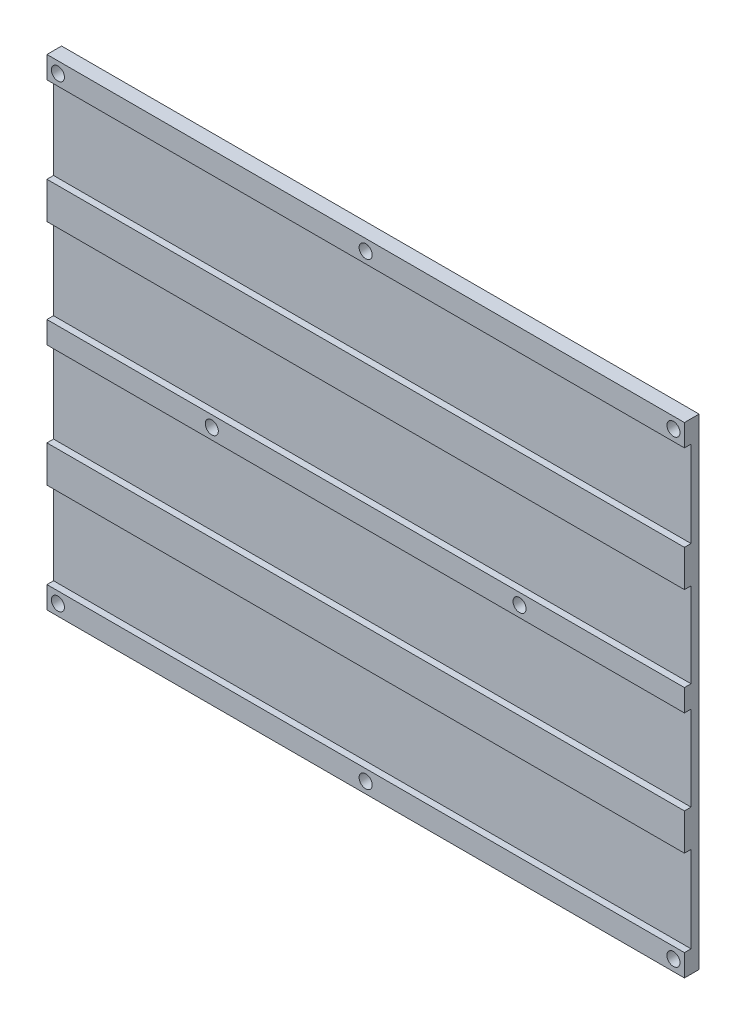
ISO-10303-21;
HEADER;
FILE_DESCRIPTION(('STEP AP214'),'2;1');
FILE_NAME('part.step','',(''),(''),'','','');
FILE_SCHEMA(('AUTOMOTIVE_DESIGN { 1 0 10303 214 1 1 1 1 }'));
ENDSEC;
DATA;
#1=APPLICATION_CONTEXT('core data for automotive mechanical design processes');
#2=APPLICATION_PROTOCOL_DEFINITION('international standard','automotive_design',2000,#1);
#3=PRODUCT_CONTEXT('',#1,'mechanical');
#4=PRODUCT('Part','Part','',(#3));
#5=PRODUCT_RELATED_PRODUCT_CATEGORY('part','',(#4));
#6=PRODUCT_DEFINITION_FORMATION('','',#4);
#7=PRODUCT_DEFINITION_CONTEXT('part definition',#1,'design');
#8=PRODUCT_DEFINITION('design','',#6,#7);
#9=PRODUCT_DEFINITION_SHAPE('','',#8);
#10=(LENGTH_UNIT() NAMED_UNIT(*) SI_UNIT(.MILLI.,.METRE.));
#11=(NAMED_UNIT(*) PLANE_ANGLE_UNIT() SI_UNIT($,.RADIAN.));
#12=(NAMED_UNIT(*) SI_UNIT($,.STERADIAN.) SOLID_ANGLE_UNIT());
#13=UNCERTAINTY_MEASURE_WITH_UNIT(LENGTH_MEASURE(1.E-05),#10,'distance_accuracy_value','');
#14=(GEOMETRIC_REPRESENTATION_CONTEXT(3) GLOBAL_UNCERTAINTY_ASSIGNED_CONTEXT((#13)) GLOBAL_UNIT_ASSIGNED_CONTEXT((#10,
#11,#12)) REPRESENTATION_CONTEXT('',''));
#15=CARTESIAN_POINT('',(0.,0.,0.));
#16=DIRECTION('',(0.,0.,1.));
#17=DIRECTION('',(1.,0.,0.));
#18=AXIS2_PLACEMENT_3D('',#15,#16,#17);
#19=CARTESIAN_POINT('',(-84.,-62.65,0.));
#20=DIRECTION('',(0.,0.,1.));
#21=DIRECTION('',(1.,0.,0.));
#22=AXIS2_PLACEMENT_3D('',#19,#20,#21);
#23=CYLINDRICAL_SURFACE('',#22,1.78435);
#24=CARTESIAN_POINT('',(-84.,-62.65,0.));
#25=DIRECTION('',(0.,0.,1.));
#26=DIRECTION('',(1.,0.,0.));
#27=AXIS2_PLACEMENT_3D('',#24,#25,#26);
#28=CIRCLE('',#27,1.78435);
#29=CARTESIAN_POINT('',(-82.21565,-62.65,0.));
#30=VERTEX_POINT('',#29);
#31=EDGE_CURVE('E285',#30,#30,#28,.F.);
#32=ORIENTED_EDGE('',*,*,#31,.F.);
#33=EDGE_LOOP('',(#32));
#34=FACE_BOUND('',#33,.T.);
#35=CARTESIAN_POINT('',(-84.,-62.65,-2.83162832727157));
#36=DIRECTION('',(0.,0.,-1.));
#37=DIRECTION('',(-1.,0.,0.));
#38=AXIS2_PLACEMENT_3D('',#35,#36,#37);
#39=CIRCLE('',#38,1.78434999998307);
#40=CARTESIAN_POINT('',(-85.7843499999831,-62.65,-2.83162832727157));
#41=VERTEX_POINT('',#40);
#42=EDGE_CURVE('E188',#41,#41,#39,.T.);
#43=ORIENTED_EDGE('',*,*,#42,.T.);
#44=EDGE_LOOP('',(#43));
#45=FACE_BOUND('',#44,.T.);
#46=ADVANCED_FACE('F16',(#34,#45),#23,.F.);
#47=CARTESIAN_POINT('',(-84.,62.65,0.));
#48=DIRECTION('',(0.,0.,1.));
#49=DIRECTION('',(1.,0.,0.));
#50=AXIS2_PLACEMENT_3D('',#47,#48,#49);
#51=CYLINDRICAL_SURFACE('',#50,1.78435);
#52=CARTESIAN_POINT('',(-84.,62.65,0.));
#53=DIRECTION('',(0.,0.,1.));
#54=DIRECTION('',(1.,0.,0.));
#55=AXIS2_PLACEMENT_3D('',#52,#53,#54);
#56=CIRCLE('',#55,1.78435);
#57=CARTESIAN_POINT('',(-82.21565,62.65,0.));
#58=VERTEX_POINT('',#57);
#59=EDGE_CURVE('E192',#58,#58,#56,.F.);
#60=ORIENTED_EDGE('',*,*,#59,.F.);
#61=EDGE_LOOP('',(#60));
#62=FACE_BOUND('',#61,.T.);
#63=CARTESIAN_POINT('',(-84.,62.65,-2.83162832727157));
#64=DIRECTION('',(0.,0.,-1.));
#65=DIRECTION('',(-1.,0.,0.));
#66=AXIS2_PLACEMENT_3D('',#63,#64,#65);
#67=CIRCLE('',#66,1.78434999998305);
#68=CARTESIAN_POINT('',(-85.7843499999831,62.65,-2.83162832727157));
#69=VERTEX_POINT('',#68);
#70=EDGE_CURVE('E246',#69,#69,#67,.T.);
#71=ORIENTED_EDGE('',*,*,#70,.T.);
#72=EDGE_LOOP('',(#71));
#73=FACE_BOUND('',#72,.T.);
#74=ADVANCED_FACE('F305',(#62,#73),#51,.F.);
#75=CARTESIAN_POINT('',(-42.,0.,0.));
#76=DIRECTION('',(0.,0.,1.));
#77=DIRECTION('',(1.,0.,0.));
#78=AXIS2_PLACEMENT_3D('',#75,#76,#77);
#79=CYLINDRICAL_SURFACE('',#78,1.78435);
#80=CARTESIAN_POINT('',(-42.,0.,0.));
#81=DIRECTION('',(0.,0.,1.));
#82=DIRECTION('',(1.,0.,0.));
#83=AXIS2_PLACEMENT_3D('',#80,#81,#82);
#84=CIRCLE('',#83,1.78435);
#85=CARTESIAN_POINT('',(-40.21565,0.,0.));
#86=VERTEX_POINT('',#85);
#87=EDGE_CURVE('E19',#86,#86,#84,.F.);
#88=ORIENTED_EDGE('',*,*,#87,.F.);
#89=EDGE_LOOP('',(#88));
#90=FACE_BOUND('',#89,.T.);
#91=CARTESIAN_POINT('',(-42.,0.,-2.83162832721473));
#92=DIRECTION('',(0.,0.,-1.));
#93=DIRECTION('',(-1.,0.,0.));
#94=AXIS2_PLACEMENT_3D('',#91,#92,#93);
#95=CIRCLE('',#94,1.78435000000991);
#96=CARTESIAN_POINT('',(-43.7843500000099,0.,-2.83162832721473));
#97=VERTEX_POINT('',#96);
#98=EDGE_CURVE('E243',#97,#97,#95,.T.);
#99=ORIENTED_EDGE('',*,*,#98,.T.);
#100=EDGE_LOOP('',(#99));
#101=FACE_BOUND('',#100,.T.);
#102=ADVANCED_FACE('F301',(#90,#101),#79,.F.);
#103=CARTESIAN_POINT('',(0.,62.65,0.));
#104=DIRECTION('',(0.,0.,1.));
#105=DIRECTION('',(1.,0.,0.));
#106=AXIS2_PLACEMENT_3D('',#103,#104,#105);
#107=CYLINDRICAL_SURFACE('',#106,1.78435);
#108=CARTESIAN_POINT('',(0.,62.65,0.));
#109=DIRECTION('',(0.,0.,1.));
#110=DIRECTION('',(1.,0.,0.));
#111=AXIS2_PLACEMENT_3D('',#108,#109,#110);
#112=CIRCLE('',#111,1.78435);
#113=CARTESIAN_POINT('',(1.78435,62.65,0.));
#114=VERTEX_POINT('',#113);
#115=EDGE_CURVE('E279',#114,#114,#112,.F.);
#116=ORIENTED_EDGE('',*,*,#115,.F.);
#117=EDGE_LOOP('',(#116));
#118=FACE_BOUND('',#117,.T.);
#119=CARTESIAN_POINT('',(0.,62.65,-2.83162832715789));
#120=DIRECTION('',(0.,0.,-1.));
#121=DIRECTION('',(-1.,0.,0.));
#122=AXIS2_PLACEMENT_3D('',#119,#120,#121);
#123=CIRCLE('',#122,1.78434999992305);
#124=CARTESIAN_POINT('',(-1.78434999992305,62.65,-2.83162832715789));
#125=VERTEX_POINT('',#124);
#126=EDGE_CURVE('E240',#125,#125,#123,.T.);
#127=ORIENTED_EDGE('',*,*,#126,.T.);
#128=EDGE_LOOP('',(#127));
#129=FACE_BOUND('',#128,.T.);
#130=ADVANCED_FACE('F304',(#118,#129),#107,.F.);
#131=CARTESIAN_POINT('',(0.,-62.65,0.));
#132=DIRECTION('',(0.,0.,1.));
#133=DIRECTION('',(1.,0.,0.));
#134=AXIS2_PLACEMENT_3D('',#131,#132,#133);
#135=CYLINDRICAL_SURFACE('',#134,1.78435);
#136=CARTESIAN_POINT('',(0.,-62.65,0.));
#137=DIRECTION('',(0.,0.,1.));
#138=DIRECTION('',(1.,0.,0.));
#139=AXIS2_PLACEMENT_3D('',#136,#137,#138);
#140=CIRCLE('',#139,1.78435);
#141=CARTESIAN_POINT('',(1.78435000000001,-62.65,0.));
#142=VERTEX_POINT('',#141);
#143=EDGE_CURVE('E288',#142,#142,#140,.F.);
#144=ORIENTED_EDGE('',*,*,#143,.F.);
#145=EDGE_LOOP('',(#144));
#146=FACE_BOUND('',#145,.T.);
#147=CARTESIAN_POINT('',(0.,-62.65,-2.83162832715789));
#148=DIRECTION('',(0.,0.,-1.));
#149=DIRECTION('',(-1.,0.,0.));
#150=AXIS2_PLACEMENT_3D('',#147,#148,#149);
#151=CIRCLE('',#150,1.78434999992307);
#152=CARTESIAN_POINT('',(-1.78434999992305,-62.65,-2.83162832715789));
#153=VERTEX_POINT('',#152);
#154=EDGE_CURVE('E237',#153,#153,#151,.T.);
#155=ORIENTED_EDGE('',*,*,#154,.T.);
#156=EDGE_LOOP('',(#155));
#157=FACE_BOUND('',#156,.T.);
#158=ADVANCED_FACE('F368',(#146,#157),#135,.F.);
#159=CARTESIAN_POINT('',(84.,-62.65,0.));
#160=DIRECTION('',(0.,0.,1.));
#161=DIRECTION('',(1.,0.,0.));
#162=AXIS2_PLACEMENT_3D('',#159,#160,#161);
#163=CYLINDRICAL_SURFACE('',#162,1.78435);
#164=CARTESIAN_POINT('',(84.,-62.65,0.));
#165=DIRECTION('',(0.,0.,1.));
#166=DIRECTION('',(1.,0.,0.));
#167=AXIS2_PLACEMENT_3D('',#164,#165,#166);
#168=CIRCLE('',#167,1.78435);
#169=CARTESIAN_POINT('',(85.78435,-62.65,0.));
#170=VERTEX_POINT('',#169);
#171=EDGE_CURVE('E195',#170,#170,#168,.F.);
#172=ORIENTED_EDGE('',*,*,#171,.F.);
#173=EDGE_LOOP('',(#172));
#174=FACE_BOUND('',#173,.T.);
#175=CARTESIAN_POINT('',(84.,-62.65,-2.83162832727157));
#176=DIRECTION('',(0.,0.,-1.));
#177=DIRECTION('',(-1.,0.,0.));
#178=AXIS2_PLACEMENT_3D('',#175,#176,#177);
#179=CIRCLE('',#178,1.78434999997672);
#180=CARTESIAN_POINT('',(82.2156500000233,-62.65,-2.83162832727157));
#181=VERTEX_POINT('',#180);
#182=EDGE_CURVE('E234',#181,#181,#179,.T.);
#183=ORIENTED_EDGE('',*,*,#182,.T.);
#184=EDGE_LOOP('',(#183));
#185=FACE_BOUND('',#184,.T.);
#186=ADVANCED_FACE('F370',(#174,#185),#163,.F.);
#187=CARTESIAN_POINT('',(42.,0.,0.));
#188=DIRECTION('',(0.,0.,1.));
#189=DIRECTION('',(1.,0.,0.));
#190=AXIS2_PLACEMENT_3D('',#187,#188,#189);
#191=CYLINDRICAL_SURFACE('',#190,1.78435);
#192=CARTESIAN_POINT('',(42.,0.,0.));
#193=DIRECTION('',(0.,0.,1.));
#194=DIRECTION('',(1.,0.,0.));
#195=AXIS2_PLACEMENT_3D('',#192,#193,#194);
#196=CIRCLE('',#195,1.78435);
#197=CARTESIAN_POINT('',(43.78435,0.,0.));
#198=VERTEX_POINT('',#197);
#199=EDGE_CURVE('E216',#198,#198,#196,.F.);
#200=ORIENTED_EDGE('',*,*,#199,.F.);
#201=EDGE_LOOP('',(#200));
#202=FACE_BOUND('',#201,.T.);
#203=CARTESIAN_POINT('',(42.,0.,-2.83162832721473));
#204=DIRECTION('',(0.,0.,-1.));
#205=DIRECTION('',(-1.,0.,0.));
#206=AXIS2_PLACEMENT_3D('',#203,#204,#205);
#207=CIRCLE('',#206,1.78435000000673);
#208=CARTESIAN_POINT('',(40.2156499999933,0.,-2.83162832721473));
#209=VERTEX_POINT('',#208);
#210=EDGE_CURVE('E231',#209,#209,#207,.T.);
#211=ORIENTED_EDGE('',*,*,#210,.T.);
#212=EDGE_LOOP('',(#211));
#213=FACE_BOUND('',#212,.T.);
#214=ADVANCED_FACE('F377',(#202,#213),#191,.F.);
#215=CARTESIAN_POINT('',(84.,62.65,0.));
#216=DIRECTION('',(0.,0.,1.));
#217=DIRECTION('',(1.,0.,0.));
#218=AXIS2_PLACEMENT_3D('',#215,#216,#217);
#219=CYLINDRICAL_SURFACE('',#218,1.78435);
#220=CARTESIAN_POINT('',(84.,62.65,0.));
#221=DIRECTION('',(0.,0.,1.));
#222=DIRECTION('',(1.,0.,0.));
#223=AXIS2_PLACEMENT_3D('',#220,#221,#222);
#224=CIRCLE('',#223,1.78435);
#225=CARTESIAN_POINT('',(85.78435,62.65,0.));
#226=VERTEX_POINT('',#225);
#227=EDGE_CURVE('E282',#226,#226,#224,.F.);
#228=ORIENTED_EDGE('',*,*,#227,.F.);
#229=EDGE_LOOP('',(#228));
#230=FACE_BOUND('',#229,.T.);
#231=CARTESIAN_POINT('',(84.,62.65,-2.83162832727157));
#232=DIRECTION('',(0.,0.,-1.));
#233=DIRECTION('',(-1.,0.,0.));
#234=AXIS2_PLACEMENT_3D('',#231,#232,#233);
#235=CIRCLE('',#234,1.7843499999767);
#236=CARTESIAN_POINT('',(82.2156500000233,62.65,-2.83162832727157));
#237=VERTEX_POINT('',#236);
#238=EDGE_CURVE('E187',#237,#237,#235,.T.);
#239=ORIENTED_EDGE('',*,*,#238,.T.);
#240=EDGE_LOOP('',(#239));
#241=FACE_BOUND('',#240,.T.);
#242=ADVANCED_FACE('F586',(#230,#241),#219,.F.);
#243=CARTESIAN_POINT('',(-87.,36.15,-1.8));
#244=DIRECTION('',(0.,-1.,0.));
#245=DIRECTION('',(0.,0.,-1.));
#246=AXIS2_PLACEMENT_3D('',#243,#244,#245);
#247=PLANE('',#246);
#248=DIRECTION('',(0.,0.,1.));
#249=VECTOR('',#248,1.);
#250=CARTESIAN_POINT('',(-87.,36.15,-4.));
#251=LINE('',#250,#249);
#252=CARTESIAN_POINT('',(-87.,36.15,0.));
#253=VERTEX_POINT('',#252);
#254=CARTESIAN_POINT('',(-87.,36.15,-1.8));
#255=VERTEX_POINT('',#254);
#256=EDGE_CURVE('E156',#253,#255,#251,.F.);
#257=ORIENTED_EDGE('',*,*,#256,.F.);
#258=DIRECTION('',(1.,0.,0.));
#259=VECTOR('',#258,1.);
#260=CARTESIAN_POINT('',(0.,36.15,0.));
#261=LINE('',#260,#259);
#262=CARTESIAN_POINT('',(87.,36.15,0.));
#263=VERTEX_POINT('',#262);
#264=EDGE_CURVE('E150',#263,#253,#261,.F.);
#265=ORIENTED_EDGE('',*,*,#264,.F.);
#266=DIRECTION('',(0.,0.,1.));
#267=VECTOR('',#266,1.);
#268=CARTESIAN_POINT('',(87.,36.15,-4.));
#269=LINE('',#268,#267);
#270=CARTESIAN_POINT('',(87.,36.15,-1.8));
#271=VERTEX_POINT('',#270);
#272=EDGE_CURVE('E171',#271,#263,#269,.T.);
#273=ORIENTED_EDGE('',*,*,#272,.F.);
#274=DIRECTION('',(-1.,0.,0.));
#275=VECTOR('',#274,1.);
#276=CARTESIAN_POINT('',(-87.,36.15,-1.8));
#277=LINE('',#276,#275);
#278=EDGE_CURVE('E169',#271,#255,#277,.T.);
#279=ORIENTED_EDGE('',*,*,#278,.T.);
#280=EDGE_LOOP('',(#257,#265,#273,#279));
#281=FACE_BOUND('',#280,.T.);
#282=ADVANCED_FACE('F170',(#281),#247,.F.);
#283=CARTESIAN_POINT('',(0.,0.,0.));
#284=DIRECTION('',(0.,0.,1.));
#285=DIRECTION('',(1.,0.,0.));
#286=AXIS2_PLACEMENT_3D('',#283,#284,#285);
#287=PLANE('',#286);
#288=DIRECTION('',(1.,0.,0.));
#289=VECTOR('',#288,1.);
#290=CARTESIAN_POINT('',(-87.,26.15,0.));
#291=LINE('',#290,#289);
#292=CARTESIAN_POINT('',(-87.,26.15,0.));
#293=VERTEX_POINT('',#292);
#294=CARTESIAN_POINT('',(87.,26.15,0.));
#295=VERTEX_POINT('',#294);
#296=EDGE_CURVE('E225',#293,#295,#291,.T.);
#297=ORIENTED_EDGE('',*,*,#296,.T.);
#298=DIRECTION('',(0.,1.,0.));
#299=VECTOR('',#298,1.);
#300=CARTESIAN_POINT('',(87.,65.65,0.));
#301=LINE('',#300,#299);
#302=EDGE_CURVE('E459',#263,#295,#301,.F.);
#303=ORIENTED_EDGE('',*,*,#302,.F.);
#304=ORIENTED_EDGE('',*,*,#264,.T.);
#305=DIRECTION('',(0.,-1.,0.));
#306=VECTOR('',#305,1.);
#307=CARTESIAN_POINT('',(-87.,65.65,0.));
#308=LINE('',#307,#306);
#309=EDGE_CURVE('E164',#293,#253,#308,.F.);
#310=ORIENTED_EDGE('',*,*,#309,.F.);
#311=EDGE_LOOP('',(#297,#303,#304,#310));
#312=FACE_BOUND('',#311,.T.);
#313=ADVANCED_FACE('F546',(#312),#287,.T.);
#314=CARTESIAN_POINT('',(-87.,26.15,0.));
#315=DIRECTION('',(0.,1.,0.));
#316=DIRECTION('',(0.,0.,1.));
#317=AXIS2_PLACEMENT_3D('',#314,#315,#316);
#318=PLANE('',#317);
#319=DIRECTION('',(0.,0.,1.));
#320=VECTOR('',#319,1.);
#321=CARTESIAN_POINT('',(-87.,26.15,-4.));
#322=LINE('',#321,#320);
#323=CARTESIAN_POINT('',(-87.,26.15,-1.8));
#324=VERTEX_POINT('',#323);
#325=EDGE_CURVE('E451',#324,#293,#322,.T.);
#326=ORIENTED_EDGE('',*,*,#325,.F.);
#327=DIRECTION('',(-1.,0.,0.));
#328=VECTOR('',#327,1.);
#329=CARTESIAN_POINT('',(-87.,26.15,-1.8));
#330=LINE('',#329,#328);
#331=CARTESIAN_POINT('',(87.,26.15,-1.8));
#332=VERTEX_POINT('',#331);
#333=EDGE_CURVE('E222',#324,#332,#330,.F.);
#334=ORIENTED_EDGE('',*,*,#333,.T.);
#335=DIRECTION('',(0.,0.,1.));
#336=VECTOR('',#335,1.);
#337=CARTESIAN_POINT('',(87.,26.15,-4.));
#338=LINE('',#337,#336);
#339=EDGE_CURVE('E461',#295,#332,#338,.F.);
#340=ORIENTED_EDGE('',*,*,#339,.F.);
#341=ORIENTED_EDGE('',*,*,#296,.F.);
#342=EDGE_LOOP('',(#326,#334,#340,#341));
#343=FACE_BOUND('',#342,.T.);
#344=ADVANCED_FACE('F544',(#343),#318,.F.);
#345=CARTESIAN_POINT('',(-87.,26.15,-1.8));
#346=DIRECTION('',(0.,0.,-1.));
#347=DIRECTION('',(-1.,0.,0.));
#348=AXIS2_PLACEMENT_3D('',#345,#346,#347);
#349=PLANE('',#348);
#350=DIRECTION('',(0.,-1.,0.));
#351=VECTOR('',#350,1.);
#352=CARTESIAN_POINT('',(-87.,65.65,-1.8));
#353=LINE('',#352,#351);
#354=CARTESIAN_POINT('',(-87.,3.,-1.8));
#355=VERTEX_POINT('',#354);
#356=EDGE_CURVE('E448',#355,#324,#353,.F.);
#357=ORIENTED_EDGE('',*,*,#356,.F.);
#358=DIRECTION('',(1.,0.,0.));
#359=VECTOR('',#358,1.);
#360=CARTESIAN_POINT('',(-87.,3.,-1.8));
#361=LINE('',#360,#359);
#362=CARTESIAN_POINT('',(87.,3.,-1.8));
#363=VERTEX_POINT('',#362);
#364=EDGE_CURVE('E219',#355,#363,#361,.T.);
#365=ORIENTED_EDGE('',*,*,#364,.T.);
#366=DIRECTION('',(0.,1.,0.));
#367=VECTOR('',#366,1.);
#368=CARTESIAN_POINT('',(87.,65.65,-1.8));
#369=LINE('',#368,#367);
#370=EDGE_CURVE('E463',#332,#363,#369,.F.);
#371=ORIENTED_EDGE('',*,*,#370,.F.);
#372=ORIENTED_EDGE('',*,*,#333,.F.);
#373=EDGE_LOOP('',(#357,#365,#371,#372));
#374=FACE_BOUND('',#373,.T.);
#375=ADVANCED_FACE('F541',(#374),#349,.F.);
#376=CARTESIAN_POINT('',(-87.,3.,0.));
#377=DIRECTION('',(0.,-1.,0.));
#378=DIRECTION('',(0.,0.,-1.));
#379=AXIS2_PLACEMENT_3D('',#376,#377,#378);
#380=PLANE('',#379);
#381=DIRECTION('',(0.,0.,1.));
#382=VECTOR('',#381,1.);
#383=CARTESIAN_POINT('',(-87.,3.,-4.));
#384=LINE('',#383,#382);
#385=CARTESIAN_POINT('',(-87.,3.,0.));
#386=VERTEX_POINT('',#385);
#387=EDGE_CURVE('E445',#386,#355,#384,.F.);
#388=ORIENTED_EDGE('',*,*,#387,.F.);
#389=DIRECTION('',(1.,0.,0.));
#390=VECTOR('',#389,1.);
#391=CARTESIAN_POINT('',(0.,3.,0.));
#392=LINE('',#391,#390);
#393=CARTESIAN_POINT('',(87.,3.,0.));
#394=VERTEX_POINT('',#393);
#395=EDGE_CURVE('E217',#394,#386,#392,.F.);
#396=ORIENTED_EDGE('',*,*,#395,.F.);
#397=DIRECTION('',(0.,0.,1.));
#398=VECTOR('',#397,1.);
#399=CARTESIAN_POINT('',(87.,3.,-4.));
#400=LINE('',#399,#398);
#401=EDGE_CURVE('E465',#363,#394,#400,.T.);
#402=ORIENTED_EDGE('',*,*,#401,.F.);
#403=ORIENTED_EDGE('',*,*,#364,.F.);
#404=EDGE_LOOP('',(#388,#396,#402,#403));
#405=FACE_BOUND('',#404,.T.);
#406=ADVANCED_FACE('F537',(#405),#380,.F.);
#407=CARTESIAN_POINT('',(0.,0.,0.));
#408=DIRECTION('',(0.,0.,1.));
#409=DIRECTION('',(1.,0.,0.));
#410=AXIS2_PLACEMENT_3D('',#407,#408,#409);
#411=PLANE('',#410);
#412=ORIENTED_EDGE('',*,*,#199,.T.);
#413=EDGE_LOOP('',(#412));
#414=FACE_BOUND('',#413,.T.);
#415=ORIENTED_EDGE('',*,*,#87,.T.);
#416=EDGE_LOOP('',(#415));
#417=FACE_BOUND('',#416,.T.);
#418=ORIENTED_EDGE('',*,*,#395,.T.);
#419=DIRECTION('',(0.,-1.,0.));
#420=VECTOR('',#419,1.);
#421=CARTESIAN_POINT('',(-87.,65.65,0.));
#422=LINE('',#421,#420);
#423=CARTESIAN_POINT('',(-87.,-3.,0.));
#424=VERTEX_POINT('',#423);
#425=EDGE_CURVE('E442',#424,#386,#422,.F.);
#426=ORIENTED_EDGE('',*,*,#425,.F.);
#427=DIRECTION('',(1.,0.,0.));
#428=VECTOR('',#427,1.);
#429=CARTESIAN_POINT('',(-87.,-3.,0.));
#430=LINE('',#429,#428);
#431=CARTESIAN_POINT('',(87.,-3.,0.));
#432=VERTEX_POINT('',#431);
#433=EDGE_CURVE('E213',#424,#432,#430,.T.);
#434=ORIENTED_EDGE('',*,*,#433,.T.);
#435=DIRECTION('',(0.,1.,0.));
#436=VECTOR('',#435,1.);
#437=CARTESIAN_POINT('',(87.,65.65,0.));
#438=LINE('',#437,#436);
#439=EDGE_CURVE('E467',#394,#432,#438,.F.);
#440=ORIENTED_EDGE('',*,*,#439,.F.);
#441=EDGE_LOOP('',(#418,#426,#434,#440));
#442=FACE_BOUND('',#441,.T.);
#443=ADVANCED_FACE('F298',(#414,#417,#442),#411,.T.);
#444=CARTESIAN_POINT('',(-87.,-3.,-1.8));
#445=DIRECTION('',(0.,1.,0.));
#446=DIRECTION('',(0.,0.,1.));
#447=AXIS2_PLACEMENT_3D('',#444,#445,#446);
#448=PLANE('',#447);
#449=DIRECTION('',(0.,0.,1.));
#450=VECTOR('',#449,1.);
#451=CARTESIAN_POINT('',(-87.,-3.,-4.));
#452=LINE('',#451,#450);
#453=CARTESIAN_POINT('',(-87.,-3.,-1.8));
#454=VERTEX_POINT('',#453);
#455=EDGE_CURVE('E439',#454,#424,#452,.T.);
#456=ORIENTED_EDGE('',*,*,#455,.F.);
#457=DIRECTION('',(-1.,0.,0.));
#458=VECTOR('',#457,1.);
#459=CARTESIAN_POINT('',(-87.,-3.,-1.8));
#460=LINE('',#459,#458);
#461=CARTESIAN_POINT('',(87.,-3.,-1.8));
#462=VERTEX_POINT('',#461);
#463=EDGE_CURVE('E210',#454,#462,#460,.F.);
#464=ORIENTED_EDGE('',*,*,#463,.T.);
#465=DIRECTION('',(0.,0.,1.));
#466=VECTOR('',#465,1.);
#467=CARTESIAN_POINT('',(87.,-3.,-4.));
#468=LINE('',#467,#466);
#469=EDGE_CURVE('E469',#432,#462,#468,.F.);
#470=ORIENTED_EDGE('',*,*,#469,.F.);
#471=ORIENTED_EDGE('',*,*,#433,.F.);
#472=EDGE_LOOP('',(#456,#464,#470,#471));
#473=FACE_BOUND('',#472,.T.);
#474=ADVANCED_FACE('F530',(#473),#448,.F.);
#475=CARTESIAN_POINT('',(-87.,-26.15,-1.8));
#476=DIRECTION('',(0.,0.,-1.));
#477=DIRECTION('',(-1.,0.,0.));
#478=AXIS2_PLACEMENT_3D('',#475,#476,#477);
#479=PLANE('',#478);
#480=DIRECTION('',(0.,-1.,0.));
#481=VECTOR('',#480,1.);
#482=CARTESIAN_POINT('',(-87.,65.65,-1.8));
#483=LINE('',#482,#481);
#484=CARTESIAN_POINT('',(-87.,-26.15,-1.8));
#485=VERTEX_POINT('',#484);
#486=EDGE_CURVE('E436',#485,#454,#483,.F.);
#487=ORIENTED_EDGE('',*,*,#486,.F.);
#488=DIRECTION('',(1.,0.,0.));
#489=VECTOR('',#488,1.);
#490=CARTESIAN_POINT('',(-87.,-26.15,-1.8));
#491=LINE('',#490,#489);
#492=CARTESIAN_POINT('',(87.,-26.15,-1.8));
#493=VERTEX_POINT('',#492);
#494=EDGE_CURVE('E207',#485,#493,#491,.T.);
#495=ORIENTED_EDGE('',*,*,#494,.T.);
#496=DIRECTION('',(0.,1.,0.));
#497=VECTOR('',#496,1.);
#498=CARTESIAN_POINT('',(87.,65.65,-1.8));
#499=LINE('',#498,#497);
#500=EDGE_CURVE('E471',#462,#493,#499,.F.);
#501=ORIENTED_EDGE('',*,*,#500,.F.);
#502=ORIENTED_EDGE('',*,*,#463,.F.);
#503=EDGE_LOOP('',(#487,#495,#501,#502));
#504=FACE_BOUND('',#503,.T.);
#505=ADVANCED_FACE('F526',(#504),#479,.F.);
#506=CARTESIAN_POINT('',(-87.,-26.15,-1.8));
#507=DIRECTION('',(0.,-1.,0.));
#508=DIRECTION('',(0.,0.,-1.));
#509=AXIS2_PLACEMENT_3D('',#506,#507,#508);
#510=PLANE('',#509);
#511=DIRECTION('',(0.,0.,1.));
#512=VECTOR('',#511,1.);
#513=CARTESIAN_POINT('',(-87.,-26.15,-4.));
#514=LINE('',#513,#512);
#515=CARTESIAN_POINT('',(-87.,-26.15,0.));
#516=VERTEX_POINT('',#515);
#517=EDGE_CURVE('E433',#516,#485,#514,.F.);
#518=ORIENTED_EDGE('',*,*,#517,.F.);
#519=DIRECTION('',(1.,0.,0.));
#520=VECTOR('',#519,1.);
#521=CARTESIAN_POINT('',(0.,-26.15,0.));
#522=LINE('',#521,#520);
#523=CARTESIAN_POINT('',(87.,-26.15,0.));
#524=VERTEX_POINT('',#523);
#525=EDGE_CURVE('E205',#524,#516,#522,.F.);
#526=ORIENTED_EDGE('',*,*,#525,.F.);
#527=DIRECTION('',(0.,0.,1.));
#528=VECTOR('',#527,1.);
#529=CARTESIAN_POINT('',(87.,-26.15,-4.));
#530=LINE('',#529,#528);
#531=EDGE_CURVE('E473',#493,#524,#530,.T.);
#532=ORIENTED_EDGE('',*,*,#531,.F.);
#533=ORIENTED_EDGE('',*,*,#494,.F.);
#534=EDGE_LOOP('',(#518,#526,#532,#533));
#535=FACE_BOUND('',#534,.T.);
#536=ADVANCED_FACE('F522',(#535),#510,.F.);
#537=CARTESIAN_POINT('',(0.,0.,0.));
#538=DIRECTION('',(0.,0.,1.));
#539=DIRECTION('',(1.,0.,0.));
#540=AXIS2_PLACEMENT_3D('',#537,#538,#539);
#541=PLANE('',#540);
#542=DIRECTION('',(1.,0.,0.));
#543=VECTOR('',#542,1.);
#544=CARTESIAN_POINT('',(-87.,-36.15,0.));
#545=LINE('',#544,#543);
#546=CARTESIAN_POINT('',(-87.,-36.15,0.));
#547=VERTEX_POINT('',#546);
#548=CARTESIAN_POINT('',(87.,-36.15,0.));
#549=VERTEX_POINT('',#548);
#550=EDGE_CURVE('E202',#547,#549,#545,.T.);
#551=ORIENTED_EDGE('',*,*,#550,.T.);
#552=DIRECTION('',(0.,1.,0.));
#553=VECTOR('',#552,1.);
#554=CARTESIAN_POINT('',(87.,65.65,0.));
#555=LINE('',#554,#553);
#556=EDGE_CURVE('E475',#524,#549,#555,.F.);
#557=ORIENTED_EDGE('',*,*,#556,.F.);
#558=ORIENTED_EDGE('',*,*,#525,.T.);
#559=DIRECTION('',(0.,-1.,0.));
#560=VECTOR('',#559,1.);
#561=CARTESIAN_POINT('',(-87.,65.65,0.));
#562=LINE('',#561,#560);
#563=EDGE_CURVE('E430',#547,#516,#562,.F.);
#564=ORIENTED_EDGE('',*,*,#563,.F.);
#565=EDGE_LOOP('',(#551,#557,#558,#564));
#566=FACE_BOUND('',#565,.T.);
#567=ADVANCED_FACE('F517',(#566),#541,.T.);
#568=CARTESIAN_POINT('',(-87.,-36.15,-1.8));
#569=DIRECTION('',(0.,1.,0.));
#570=DIRECTION('',(0.,0.,1.));
#571=AXIS2_PLACEMENT_3D('',#568,#569,#570);
#572=PLANE('',#571);
#573=DIRECTION('',(0.,0.,1.));
#574=VECTOR('',#573,1.);
#575=CARTESIAN_POINT('',(-87.,-36.15,-4.));
#576=LINE('',#575,#574);
#577=CARTESIAN_POINT('',(-87.,-36.15,-1.8));
#578=VERTEX_POINT('',#577);
#579=EDGE_CURVE('E427',#578,#547,#576,.T.);
#580=ORIENTED_EDGE('',*,*,#579,.F.);
#581=DIRECTION('',(-1.,0.,0.));
#582=VECTOR('',#581,1.);
#583=CARTESIAN_POINT('',(-87.,-36.15,-1.8));
#584=LINE('',#583,#582);
#585=CARTESIAN_POINT('',(87.0000000000001,-36.15,-1.8));
#586=VERTEX_POINT('',#585);
#587=EDGE_CURVE('E199',#578,#586,#584,.F.);
#588=ORIENTED_EDGE('',*,*,#587,.T.);
#589=DIRECTION('',(0.,0.,1.));
#590=VECTOR('',#589,1.);
#591=CARTESIAN_POINT('',(87.0000000000001,-36.15,-4.));
#592=LINE('',#591,#590);
#593=EDGE_CURVE('E477',#549,#586,#592,.F.);
#594=ORIENTED_EDGE('',*,*,#593,.F.);
#595=ORIENTED_EDGE('',*,*,#550,.F.);
#596=EDGE_LOOP('',(#580,#588,#594,#595));
#597=FACE_BOUND('',#596,.T.);
#598=ADVANCED_FACE('F513',(#597),#572,.F.);
#599=CARTESIAN_POINT('',(-87.,-59.65,-1.8));
#600=DIRECTION('',(0.,0.,-1.));
#601=DIRECTION('',(-1.,0.,0.));
#602=AXIS2_PLACEMENT_3D('',#599,#600,#601);
#603=PLANE('',#602);
#604=DIRECTION('',(0.,-1.,0.));
#605=VECTOR('',#604,1.);
#606=CARTESIAN_POINT('',(-87.,65.65,-1.8));
#607=LINE('',#606,#605);
#608=CARTESIAN_POINT('',(-87.,-59.65,-1.8));
#609=VERTEX_POINT('',#608);
#610=EDGE_CURVE('E424',#609,#578,#607,.F.);
#611=ORIENTED_EDGE('',*,*,#610,.F.);
#612=DIRECTION('',(1.,0.,0.));
#613=VECTOR('',#612,1.);
#614=CARTESIAN_POINT('',(-87.,-59.65,-1.8));
#615=LINE('',#614,#613);
#616=CARTESIAN_POINT('',(87.0000000000001,-59.65,-1.8));
#617=VERTEX_POINT('',#616);
#618=EDGE_CURVE('E196',#609,#617,#615,.T.);
#619=ORIENTED_EDGE('',*,*,#618,.T.);
#620=DIRECTION('',(0.,1.,0.));
#621=VECTOR('',#620,1.);
#622=CARTESIAN_POINT('',(87.,65.65,-1.8));
#623=LINE('',#622,#621);
#624=EDGE_CURVE('E479',#586,#617,#623,.F.);
#625=ORIENTED_EDGE('',*,*,#624,.F.);
#626=ORIENTED_EDGE('',*,*,#587,.F.);
#627=EDGE_LOOP('',(#611,#619,#625,#626));
#628=FACE_BOUND('',#627,.T.);
#629=ADVANCED_FACE('F509',(#628),#603,.F.);
#630=CARTESIAN_POINT('',(-87.,-59.65,-1.8));
#631=DIRECTION('',(0.,-1.,0.));
#632=DIRECTION('',(0.,0.,-1.));
#633=AXIS2_PLACEMENT_3D('',#630,#631,#632);
#634=PLANE('',#633);
#635=DIRECTION('',(0.,0.,1.));
#636=VECTOR('',#635,1.);
#637=CARTESIAN_POINT('',(-87.,-59.65,-4.));
#638=LINE('',#637,#636);
#639=CARTESIAN_POINT('',(-87.,-59.65,0.));
#640=VERTEX_POINT('',#639);
#641=EDGE_CURVE('E419',#640,#609,#638,.F.);
#642=ORIENTED_EDGE('',*,*,#641,.F.);
#643=DIRECTION('',(1.,0.,0.));
#644=VECTOR('',#643,1.);
#645=CARTESIAN_POINT('',(0.,-59.65,0.));
#646=LINE('',#645,#644);
#647=CARTESIAN_POINT('',(87.,-59.65,0.));
#648=VERTEX_POINT('',#647);
#649=EDGE_CURVE('E193',#648,#640,#646,.F.);
#650=ORIENTED_EDGE('',*,*,#649,.F.);
#651=DIRECTION('',(0.,0.,1.));
#652=VECTOR('',#651,1.);
#653=CARTESIAN_POINT('',(87.0000000000001,-59.65,-4.));
#654=LINE('',#653,#652);
#655=EDGE_CURVE('E481',#617,#648,#654,.T.);
#656=ORIENTED_EDGE('',*,*,#655,.F.);
#657=ORIENTED_EDGE('',*,*,#618,.F.);
#658=EDGE_LOOP('',(#642,#650,#656,#657));
#659=FACE_BOUND('',#658,.T.);
#660=ADVANCED_FACE('F504',(#659),#634,.F.);
#661=CARTESIAN_POINT('',(0.,0.,0.));
#662=DIRECTION('',(0.,0.,1.));
#663=DIRECTION('',(1.,0.,0.));
#664=AXIS2_PLACEMENT_3D('',#661,#662,#663);
#665=PLANE('',#664);
#666=ORIENTED_EDGE('',*,*,#31,.T.);
#667=EDGE_LOOP('',(#666));
#668=FACE_BOUND('',#667,.T.);
#669=ORIENTED_EDGE('',*,*,#143,.T.);
#670=EDGE_LOOP('',(#669));
#671=FACE_BOUND('',#670,.T.);
#672=ORIENTED_EDGE('',*,*,#171,.T.);
#673=EDGE_LOOP('',(#672));
#674=FACE_BOUND('',#673,.T.);
#675=DIRECTION('',(1.,0.,0.));
#676=VECTOR('',#675,1.);
#677=CARTESIAN_POINT('',(-86.9999999999999,-65.65,0.));
#678=LINE('',#677,#676);
#679=CARTESIAN_POINT('',(87.,-65.65,0.));
#680=VERTEX_POINT('',#679);
#681=CARTESIAN_POINT('',(-87.,-65.65,0.));
#682=VERTEX_POINT('',#681);
#683=EDGE_CURVE('E454',#680,#682,#678,.F.);
#684=ORIENTED_EDGE('',*,*,#683,.F.);
#685=DIRECTION('',(0.,1.,0.));
#686=VECTOR('',#685,1.);
#687=CARTESIAN_POINT('',(87.,65.65,0.));
#688=LINE('',#687,#686);
#689=EDGE_CURVE('E483',#648,#680,#688,.F.);
#690=ORIENTED_EDGE('',*,*,#689,.F.);
#691=ORIENTED_EDGE('',*,*,#649,.T.);
#692=DIRECTION('',(0.,-1.,0.));
#693=VECTOR('',#692,1.);
#694=CARTESIAN_POINT('',(-87.,65.65,0.));
#695=LINE('',#694,#693);
#696=EDGE_CURVE('E416',#682,#640,#695,.F.);
#697=ORIENTED_EDGE('',*,*,#696,.F.);
#698=EDGE_LOOP('',(#684,#690,#691,#697));
#699=FACE_BOUND('',#698,.T.);
#700=ADVANCED_FACE('F399',(#668,#671,#674,#699),#665,.T.);
#701=CARTESIAN_POINT('',(0.,0.,0.));
#702=DIRECTION('',(0.,0.,1.));
#703=DIRECTION('',(1.,0.,0.));
#704=AXIS2_PLACEMENT_3D('',#701,#702,#703);
#705=PLANE('',#704);
#706=ORIENTED_EDGE('',*,*,#59,.T.);
#707=EDGE_LOOP('',(#706));
#708=FACE_BOUND('',#707,.T.);
#709=ORIENTED_EDGE('',*,*,#115,.T.);
#710=EDGE_LOOP('',(#709));
#711=FACE_BOUND('',#710,.T.);
#712=ORIENTED_EDGE('',*,*,#227,.T.);
#713=EDGE_LOOP('',(#712));
#714=FACE_BOUND('',#713,.T.);
#715=DIRECTION('',(1.,0.,0.));
#716=VECTOR('',#715,1.);
#717=CARTESIAN_POINT('',(-87.,65.65,0.));
#718=LINE('',#717,#716);
#719=CARTESIAN_POINT('',(-87.,65.65,0.));
#720=VERTEX_POINT('',#719);
#721=CARTESIAN_POINT('',(87.,65.65,0.));
#722=VERTEX_POINT('',#721);
#723=EDGE_CURVE('E166',#720,#722,#718,.T.);
#724=ORIENTED_EDGE('',*,*,#723,.F.);
#725=DIRECTION('',(0.,-1.,0.));
#726=VECTOR('',#725,1.);
#727=CARTESIAN_POINT('',(-87.,65.65,0.));
#728=LINE('',#727,#726);
#729=CARTESIAN_POINT('',(-87.,59.65,0.));
#730=VERTEX_POINT('',#729);
#731=EDGE_CURVE('E182',#730,#720,#728,.F.);
#732=ORIENTED_EDGE('',*,*,#731,.F.);
#733=DIRECTION('',(1.,0.,0.));
#734=VECTOR('',#733,1.);
#735=CARTESIAN_POINT('',(-87.,59.65,0.));
#736=LINE('',#735,#734);
#737=CARTESIAN_POINT('',(87.,59.65,0.));
#738=VERTEX_POINT('',#737);
#739=EDGE_CURVE('E176',#730,#738,#736,.T.);
#740=ORIENTED_EDGE('',*,*,#739,.T.);
#741=DIRECTION('',(0.,1.,0.));
#742=VECTOR('',#741,1.);
#743=CARTESIAN_POINT('',(87.,65.65,0.));
#744=LINE('',#743,#742);
#745=EDGE_CURVE('E409',#722,#738,#744,.F.);
#746=ORIENTED_EDGE('',*,*,#745,.F.);
#747=EDGE_LOOP('',(#724,#732,#740,#746));
#748=FACE_BOUND('',#747,.T.);
#749=ADVANCED_FACE('F395',(#708,#711,#714,#748),#705,.T.);
#750=CARTESIAN_POINT('',(-87.,59.65,-1.8));
#751=DIRECTION('',(0.,1.,0.));
#752=DIRECTION('',(0.,0.,1.));
#753=AXIS2_PLACEMENT_3D('',#750,#751,#752);
#754=PLANE('',#753);
#755=DIRECTION('',(0.,0.,1.));
#756=VECTOR('',#755,1.);
#757=CARTESIAN_POINT('',(-87.,59.65,-4.));
#758=LINE('',#757,#756);
#759=CARTESIAN_POINT('',(-87.,59.65,-1.8));
#760=VERTEX_POINT('',#759);
#761=EDGE_CURVE('E180',#760,#730,#758,.T.);
#762=ORIENTED_EDGE('',*,*,#761,.F.);
#763=DIRECTION('',(-1.,0.,0.));
#764=VECTOR('',#763,1.);
#765=CARTESIAN_POINT('',(-87.,59.65,-1.8));
#766=LINE('',#765,#764);
#767=CARTESIAN_POINT('',(87.,59.65,-1.8));
#768=VERTEX_POINT('',#767);
#769=EDGE_CURVE('E175',#760,#768,#766,.F.);
#770=ORIENTED_EDGE('',*,*,#769,.T.);
#771=DIRECTION('',(0.,0.,1.));
#772=VECTOR('',#771,1.);
#773=CARTESIAN_POINT('',(87.,59.65,-4.));
#774=LINE('',#773,#772);
#775=EDGE_CURVE('E489',#738,#768,#774,.F.);
#776=ORIENTED_EDGE('',*,*,#775,.F.);
#777=ORIENTED_EDGE('',*,*,#739,.F.);
#778=EDGE_LOOP('',(#762,#770,#776,#777));
#779=FACE_BOUND('',#778,.T.);
#780=ADVANCED_FACE('F398',(#779),#754,.F.);
#781=CARTESIAN_POINT('',(-87.,36.15,-1.8));
#782=DIRECTION('',(0.,0.,-1.));
#783=DIRECTION('',(-1.,0.,0.));
#784=AXIS2_PLACEMENT_3D('',#781,#782,#783);
#785=PLANE('',#784);
#786=DIRECTION('',(0.,-1.,0.));
#787=VECTOR('',#786,1.);
#788=CARTESIAN_POINT('',(-87.,65.65,-1.8));
#789=LINE('',#788,#787);
#790=EDGE_CURVE('E162',#255,#760,#789,.F.);
#791=ORIENTED_EDGE('',*,*,#790,.F.);
#792=ORIENTED_EDGE('',*,*,#278,.F.);
#793=DIRECTION('',(0.,1.,0.));
#794=VECTOR('',#793,1.);
#795=CARTESIAN_POINT('',(87.,65.65,-1.8));
#796=LINE('',#795,#794);
#797=EDGE_CURVE('E276',#768,#271,#796,.F.);
#798=ORIENTED_EDGE('',*,*,#797,.F.);
#799=ORIENTED_EDGE('',*,*,#769,.F.);
#800=EDGE_LOOP('',(#791,#792,#798,#799));
#801=FACE_BOUND('',#800,.T.);
#802=ADVANCED_FACE('F178',(#801),#785,.F.);
#803=CARTESIAN_POINT('',(-84.,-62.65,-3.99999999996226));
#804=DIRECTION('',(0.,0.,-1.));
#805=DIRECTION('',(-1.,0.,0.));
#806=AXIS2_PLACEMENT_3D('',#803,#804,#805);
#807=CONICAL_SURFACE('',#806,2.7999999999256,0.715584993312981);
#808=CARTESIAN_POINT('',(-84.,-62.65,-4.00000000007594));
#809=DIRECTION('',(0.,0.,-1.));
#810=DIRECTION('',(-1.,0.,0.));
#811=AXIS2_PLACEMENT_3D('',#808,#809,#810);
#812=CIRCLE('',#811,2.80000000002442);
#813=CARTESIAN_POINT('',(-86.8000000000244,-62.65,-4.00000000007594));
#814=VERTEX_POINT('',#813);
#815=EDGE_CURVE('E273',#814,#814,#812,.T.);
#816=ORIENTED_EDGE('',*,*,#815,.T.);
#817=EDGE_LOOP('',(#816));
#818=FACE_BOUND('',#817,.T.);
#819=ORIENTED_EDGE('',*,*,#42,.F.);
#820=EDGE_LOOP('',(#819));
#821=FACE_BOUND('',#820,.T.);
#822=ADVANCED_FACE('F323',(#818,#821),#807,.F.);
#823=CARTESIAN_POINT('',(-84.,62.65,-3.99999999996226));
#824=DIRECTION('',(0.,0.,-1.));
#825=DIRECTION('',(-1.,0.,0.));
#826=AXIS2_PLACEMENT_3D('',#823,#824,#825);
#827=CONICAL_SURFACE('',#826,2.79999999992557,0.715584993312981);
#828=CARTESIAN_POINT('',(-84.,62.65,-4.00000000007594));
#829=DIRECTION('',(0.,0.,-1.));
#830=DIRECTION('',(-1.,0.,0.));
#831=AXIS2_PLACEMENT_3D('',#828,#829,#830);
#832=CIRCLE('',#831,2.8000000000244);
#833=CARTESIAN_POINT('',(-86.8000000000244,62.65,-4.00000000007594));
#834=VERTEX_POINT('',#833);
#835=EDGE_CURVE('E270',#834,#834,#832,.T.);
#836=ORIENTED_EDGE('',*,*,#835,.T.);
#837=EDGE_LOOP('',(#836));
#838=FACE_BOUND('',#837,.T.);
#839=ORIENTED_EDGE('',*,*,#70,.F.);
#840=EDGE_LOOP('',(#839));
#841=FACE_BOUND('',#840,.T.);
#842=ADVANCED_FACE('F312',(#838,#841),#827,.F.);
#843=CARTESIAN_POINT('',(-42.,0.,-4.0000000000191));
#844=DIRECTION('',(0.,0.,-1.));
#845=DIRECTION('',(-1.,0.,0.));
#846=AXIS2_PLACEMENT_3D('',#843,#844,#845);
#847=CONICAL_SURFACE('',#846,2.80000000000928,0.715584993312981);
#848=CARTESIAN_POINT('',(-42.,0.,-4.0000000000191));
#849=DIRECTION('',(0.,0.,-1.));
#850=DIRECTION('',(-1.,0.,0.));
#851=AXIS2_PLACEMENT_3D('',#848,#849,#850);
#852=CIRCLE('',#851,2.80000000000928);
#853=CARTESIAN_POINT('',(-44.8000000000093,0.,-4.0000000000191));
#854=VERTEX_POINT('',#853);
#855=EDGE_CURVE('E267',#854,#854,#852,.T.);
#856=ORIENTED_EDGE('',*,*,#855,.T.);
#857=EDGE_LOOP('',(#856));
#858=FACE_BOUND('',#857,.T.);
#859=ORIENTED_EDGE('',*,*,#98,.F.);
#860=EDGE_LOOP('',(#859));
#861=FACE_BOUND('',#860,.T.);
#862=ADVANCED_FACE('F309',(#858,#861),#847,.F.);
#863=CARTESIAN_POINT('',(0.,62.65,-3.99999999990541));
#864=DIRECTION('',(0.,0.,-1.));
#865=DIRECTION('',(-1.,0.,0.));
#866=AXIS2_PLACEMENT_3D('',#863,#864,#865);
#867=CONICAL_SURFACE('',#866,2.79999999986557,0.715584993312981);
#868=CARTESIAN_POINT('',(0.,62.65,-3.99999999996226));
#869=DIRECTION('',(0.,0.,-1.));
#870=DIRECTION('',(-1.,0.,0.));
#871=AXIS2_PLACEMENT_3D('',#868,#869,#870);
#872=CIRCLE('',#871,2.79999999991499);
#873=CARTESIAN_POINT('',(-2.79999999991499,62.65,-3.99999999996226));
#874=VERTEX_POINT('',#873);
#875=EDGE_CURVE('E264',#874,#874,#872,.T.);
#876=ORIENTED_EDGE('',*,*,#875,.T.);
#877=EDGE_LOOP('',(#876));
#878=FACE_BOUND('',#877,.T.);
#879=ORIENTED_EDGE('',*,*,#126,.F.);
#880=EDGE_LOOP('',(#879));
#881=FACE_BOUND('',#880,.T.);
#882=ADVANCED_FACE('F311',(#878,#881),#867,.F.);
#883=CARTESIAN_POINT('',(0.,-62.65,-3.99999999990541));
#884=DIRECTION('',(0.,0.,-1.));
#885=DIRECTION('',(-1.,0.,0.));
#886=AXIS2_PLACEMENT_3D('',#883,#884,#885);
#887=CONICAL_SURFACE('',#886,2.79999999986559,0.715584993312981);
#888=CARTESIAN_POINT('',(0.,-62.65,-3.99999999996226));
#889=DIRECTION('',(0.,0.,-1.));
#890=DIRECTION('',(-1.,0.,0.));
#891=AXIS2_PLACEMENT_3D('',#888,#889,#890);
#892=CIRCLE('',#891,2.799999999915);
#893=CARTESIAN_POINT('',(-2.79999999991499,-62.65,-3.99999999996226));
#894=VERTEX_POINT('',#893);
#895=EDGE_CURVE('E261',#894,#894,#892,.T.);
#896=ORIENTED_EDGE('',*,*,#895,.T.);
#897=EDGE_LOOP('',(#896));
#898=FACE_BOUND('',#897,.T.);
#899=ORIENTED_EDGE('',*,*,#154,.F.);
#900=EDGE_LOOP('',(#899));
#901=FACE_BOUND('',#900,.T.);
#902=ADVANCED_FACE('F320',(#898,#901),#887,.F.);
#903=CARTESIAN_POINT('',(84.,-62.65,-3.99999999996226));
#904=DIRECTION('',(0.,0.,-1.));
#905=DIRECTION('',(-1.,0.,0.));
#906=AXIS2_PLACEMENT_3D('',#903,#904,#905);
#907=CONICAL_SURFACE('',#906,2.79999999991924,0.715584993312981);
#908=CARTESIAN_POINT('',(84.,-62.65,-4.00000000007594));
#909=DIRECTION('',(0.,0.,-1.));
#910=DIRECTION('',(-1.,0.,0.));
#911=AXIS2_PLACEMENT_3D('',#908,#909,#910);
#912=CIRCLE('',#911,2.80000000001807);
#913=CARTESIAN_POINT('',(81.1999999999819,-62.65,-4.00000000007594));
#914=VERTEX_POINT('',#913);
#915=EDGE_CURVE('E258',#914,#914,#912,.T.);
#916=ORIENTED_EDGE('',*,*,#915,.T.);
#917=EDGE_LOOP('',(#916));
#918=FACE_BOUND('',#917,.T.);
#919=ORIENTED_EDGE('',*,*,#182,.F.);
#920=EDGE_LOOP('',(#919));
#921=FACE_BOUND('',#920,.T.);
#922=ADVANCED_FACE('F355',(#918,#921),#907,.F.);
#923=CARTESIAN_POINT('',(42.,0.,-4.0000000000191));
#924=DIRECTION('',(0.,0.,-1.));
#925=DIRECTION('',(-1.,0.,0.));
#926=AXIS2_PLACEMENT_3D('',#923,#924,#925);
#927=CONICAL_SURFACE('',#926,2.8000000000061,0.715584993312981);
#928=CARTESIAN_POINT('',(42.,0.,-4.0000000000191));
#929=DIRECTION('',(0.,0.,-1.));
#930=DIRECTION('',(-1.,0.,0.));
#931=AXIS2_PLACEMENT_3D('',#928,#929,#930);
#932=CIRCLE('',#931,2.8000000000061);
#933=CARTESIAN_POINT('',(39.1999999999939,0.,-4.0000000000191));
#934=VERTEX_POINT('',#933);
#935=EDGE_CURVE('E255',#934,#934,#932,.T.);
#936=ORIENTED_EDGE('',*,*,#935,.T.);
#937=EDGE_LOOP('',(#936));
#938=FACE_BOUND('',#937,.T.);
#939=ORIENTED_EDGE('',*,*,#210,.F.);
#940=EDGE_LOOP('',(#939));
#941=FACE_BOUND('',#940,.T.);
#942=ADVANCED_FACE('F351',(#938,#941),#927,.F.);
#943=CARTESIAN_POINT('',(84.,62.65,-3.99999999996226));
#944=DIRECTION('',(0.,0.,-1.));
#945=DIRECTION('',(-1.,0.,0.));
#946=AXIS2_PLACEMENT_3D('',#943,#944,#945);
#947=CONICAL_SURFACE('',#946,2.79999999991923,0.715584993312981);
#948=CARTESIAN_POINT('',(84.,62.65,-4.00000000007594));
#949=DIRECTION('',(0.,0.,-1.));
#950=DIRECTION('',(-1.,0.,0.));
#951=AXIS2_PLACEMENT_3D('',#948,#949,#950);
#952=CIRCLE('',#951,2.80000000001805);
#953=CARTESIAN_POINT('',(81.1999999999819,62.65,-4.00000000007594));
#954=VERTEX_POINT('',#953);
#955=EDGE_CURVE('E251',#954,#954,#952,.T.);
#956=ORIENTED_EDGE('',*,*,#955,.T.);
#957=EDGE_LOOP('',(#956));
#958=FACE_BOUND('',#957,.T.);
#959=ORIENTED_EDGE('',*,*,#238,.F.);
#960=EDGE_LOOP('',(#959));
#961=FACE_BOUND('',#960,.T.);
#962=ADVANCED_FACE('F347',(#958,#961),#947,.F.);
#963=CARTESIAN_POINT('',(-87.,65.65,-4.));
#964=DIRECTION('',(0.,1.,0.));
#965=DIRECTION('',(0.,0.,1.));
#966=AXIS2_PLACEMENT_3D('',#963,#964,#965);
#967=PLANE('',#966);
#968=DIRECTION('',(1.,0.,0.));
#969=VECTOR('',#968,1.);
#970=CARTESIAN_POINT('',(0.,65.65,-4.));
#971=LINE('',#970,#969);
#972=CARTESIAN_POINT('',(87.,65.65,-4.));
#973=VERTEX_POINT('',#972);
#974=CARTESIAN_POINT('',(-87.,65.65,-4.));
#975=VERTEX_POINT('',#974);
#976=EDGE_CURVE('E254',#973,#975,#971,.F.);
#977=ORIENTED_EDGE('',*,*,#976,.T.);
#978=DIRECTION('',(0.,0.,1.));
#979=VECTOR('',#978,1.);
#980=CARTESIAN_POINT('',(-87.,65.65,-4.));
#981=LINE('',#980,#979);
#982=EDGE_CURVE('E413',#720,#975,#981,.F.);
#983=ORIENTED_EDGE('',*,*,#982,.F.);
#984=ORIENTED_EDGE('',*,*,#723,.T.);
#985=DIRECTION('',(0.,0.,1.));
#986=VECTOR('',#985,1.);
#987=CARTESIAN_POINT('',(87.,65.65,-4.));
#988=LINE('',#987,#986);
#989=EDGE_CURVE('E486',#973,#722,#988,.T.);
#990=ORIENTED_EDGE('',*,*,#989,.F.);
#991=EDGE_LOOP('',(#977,#983,#984,#990));
#992=FACE_BOUND('',#991,.T.);
#993=ADVANCED_FACE('F344',(#992),#967,.T.);
#994=CARTESIAN_POINT('',(-87.,65.65,-4.));
#995=DIRECTION('',(-1.,0.,0.));
#996=DIRECTION('',(0.,-1.,0.));
#997=AXIS2_PLACEMENT_3D('',#994,#995,#996);
#998=PLANE('',#997);
#999=ORIENTED_EDGE('',*,*,#325,.T.);
#1000=ORIENTED_EDGE('',*,*,#309,.T.);
#1001=ORIENTED_EDGE('',*,*,#256,.T.);
#1002=ORIENTED_EDGE('',*,*,#790,.T.);
#1003=ORIENTED_EDGE('',*,*,#761,.T.);
#1004=ORIENTED_EDGE('',*,*,#731,.T.);
#1005=ORIENTED_EDGE('',*,*,#982,.T.);
#1006=DIRECTION('',(0.,1.,0.));
#1007=VECTOR('',#1006,1.);
#1008=CARTESIAN_POINT('',(-87.,0.,-4.));
#1009=LINE('',#1008,#1007);
#1010=CARTESIAN_POINT('',(-87.,-65.65,-4.));
#1011=VERTEX_POINT('',#1010);
#1012=EDGE_CURVE('E493',#975,#1011,#1009,.F.);
#1013=ORIENTED_EDGE('',*,*,#1012,.T.);
#1014=DIRECTION('',(0.,0.,-1.));
#1015=VECTOR('',#1014,1.);
#1016=CARTESIAN_POINT('',(-86.9999999999999,-65.65,-4.));
#1017=LINE('',#1016,#1015);
#1018=EDGE_CURVE('E456',#682,#1011,#1017,.T.);
#1019=ORIENTED_EDGE('',*,*,#1018,.F.);
#1020=ORIENTED_EDGE('',*,*,#696,.T.);
#1021=ORIENTED_EDGE('',*,*,#641,.T.);
#1022=ORIENTED_EDGE('',*,*,#610,.T.);
#1023=ORIENTED_EDGE('',*,*,#579,.T.);
#1024=ORIENTED_EDGE('',*,*,#563,.T.);
#1025=ORIENTED_EDGE('',*,*,#517,.T.);
#1026=ORIENTED_EDGE('',*,*,#486,.T.);
#1027=ORIENTED_EDGE('',*,*,#455,.T.);
#1028=ORIENTED_EDGE('',*,*,#425,.T.);
#1029=ORIENTED_EDGE('',*,*,#387,.T.);
#1030=ORIENTED_EDGE('',*,*,#356,.T.);
#1031=EDGE_LOOP('',(#999,#1000,#1001,#1002,#1003,#1004,#1005,#1013,#1019,#1020,#1021,#1022,
#1023,#1024,#1025,#1026,#1027,#1028,#1029,#1030));
#1032=FACE_BOUND('',#1031,.T.);
#1033=ADVANCED_FACE('F159',(#1032),#998,.T.);
#1034=CARTESIAN_POINT('',(-86.9999999999999,-65.65,-4.));
#1035=DIRECTION('',(0.,-1.,0.));
#1036=DIRECTION('',(0.,0.,-1.));
#1037=AXIS2_PLACEMENT_3D('',#1034,#1035,#1036);
#1038=PLANE('',#1037);
#1039=DIRECTION('',(1.,0.,0.));
#1040=VECTOR('',#1039,1.);
#1041=CARTESIAN_POINT('',(0.,-65.65,-4.));
#1042=LINE('',#1041,#1040);
#1043=CARTESIAN_POINT('',(87.,-65.65,-4.));
#1044=VERTEX_POINT('',#1043);
#1045=EDGE_CURVE('E25',#1011,#1044,#1042,.T.);
#1046=ORIENTED_EDGE('',*,*,#1045,.T.);
#1047=DIRECTION('',(0.,0.,1.));
#1048=VECTOR('',#1047,1.);
#1049=CARTESIAN_POINT('',(87.0000000000001,-65.65,-4.));
#1050=LINE('',#1049,#1048);
#1051=EDGE_CURVE('E33',#680,#1044,#1050,.F.);
#1052=ORIENTED_EDGE('',*,*,#1051,.F.);
#1053=ORIENTED_EDGE('',*,*,#683,.T.);
#1054=ORIENTED_EDGE('',*,*,#1018,.T.);
#1055=EDGE_LOOP('',(#1046,#1052,#1053,#1054));
#1056=FACE_BOUND('',#1055,.T.);
#1057=ADVANCED_FACE('F334',(#1056),#1038,.T.);
#1058=CARTESIAN_POINT('',(87.,65.65,-4.));
#1059=DIRECTION('',(1.,0.,0.));
#1060=DIRECTION('',(0.,1.,0.));
#1061=AXIS2_PLACEMENT_3D('',#1058,#1059,#1060);
#1062=PLANE('',#1061);
#1063=ORIENTED_EDGE('',*,*,#775,.T.);
#1064=ORIENTED_EDGE('',*,*,#797,.T.);
#1065=ORIENTED_EDGE('',*,*,#272,.T.);
#1066=ORIENTED_EDGE('',*,*,#302,.T.);
#1067=ORIENTED_EDGE('',*,*,#339,.T.);
#1068=ORIENTED_EDGE('',*,*,#370,.T.);
#1069=ORIENTED_EDGE('',*,*,#401,.T.);
#1070=ORIENTED_EDGE('',*,*,#439,.T.);
#1071=ORIENTED_EDGE('',*,*,#469,.T.);
#1072=ORIENTED_EDGE('',*,*,#500,.T.);
#1073=ORIENTED_EDGE('',*,*,#531,.T.);
#1074=ORIENTED_EDGE('',*,*,#556,.T.);
#1075=ORIENTED_EDGE('',*,*,#593,.T.);
#1076=ORIENTED_EDGE('',*,*,#624,.T.);
#1077=ORIENTED_EDGE('',*,*,#655,.T.);
#1078=ORIENTED_EDGE('',*,*,#689,.T.);
#1079=ORIENTED_EDGE('',*,*,#1051,.T.);
#1080=DIRECTION('',(0.,1.,0.));
#1081=VECTOR('',#1080,1.);
#1082=CARTESIAN_POINT('',(87.,0.,-4.));
#1083=LINE('',#1082,#1081);
#1084=EDGE_CURVE('E11',#1044,#973,#1083,.T.);
#1085=ORIENTED_EDGE('',*,*,#1084,.T.);
#1086=ORIENTED_EDGE('',*,*,#989,.T.);
#1087=ORIENTED_EDGE('',*,*,#745,.T.);
#1088=EDGE_LOOP('',(#1063,#1064,#1065,#1066,#1067,#1068,#1069,#1070,#1071,#1072,#1073,#1074,
#1075,#1076,#1077,#1078,#1079,#1085,#1086,#1087));
#1089=FACE_BOUND('',#1088,.T.);
#1090=ADVANCED_FACE('F328',(#1089),#1062,.T.);
#1091=CARTESIAN_POINT('',(0.,0.,-4.));
#1092=DIRECTION('',(0.,0.,1.));
#1093=DIRECTION('',(1.,0.,0.));
#1094=AXIS2_PLACEMENT_3D('',#1091,#1092,#1093);
#1095=PLANE('',#1094);
#1096=ORIENTED_EDGE('',*,*,#1045,.F.);
#1097=ORIENTED_EDGE('',*,*,#1012,.F.);
#1098=ORIENTED_EDGE('',*,*,#976,.F.);
#1099=ORIENTED_EDGE('',*,*,#1084,.F.);
#1100=EDGE_LOOP('',(#1096,#1097,#1098,#1099));
#1101=FACE_BOUND('',#1100,.T.);
#1102=ORIENTED_EDGE('',*,*,#955,.F.);
#1103=EDGE_LOOP('',(#1102));
#1104=FACE_BOUND('',#1103,.T.);
#1105=ORIENTED_EDGE('',*,*,#935,.F.);
#1106=EDGE_LOOP('',(#1105));
#1107=FACE_BOUND('',#1106,.T.);
#1108=ORIENTED_EDGE('',*,*,#915,.F.);
#1109=EDGE_LOOP('',(#1108));
#1110=FACE_BOUND('',#1109,.T.);
#1111=ORIENTED_EDGE('',*,*,#895,.F.);
#1112=EDGE_LOOP('',(#1111));
#1113=FACE_BOUND('',#1112,.T.);
#1114=ORIENTED_EDGE('',*,*,#875,.F.);
#1115=EDGE_LOOP('',(#1114));
#1116=FACE_BOUND('',#1115,.T.);
#1117=ORIENTED_EDGE('',*,*,#855,.F.);
#1118=EDGE_LOOP('',(#1117));
#1119=FACE_BOUND('',#1118,.T.);
#1120=ORIENTED_EDGE('',*,*,#835,.F.);
#1121=EDGE_LOOP('',(#1120));
#1122=FACE_BOUND('',#1121,.T.);
#1123=ORIENTED_EDGE('',*,*,#815,.F.);
#1124=EDGE_LOOP('',(#1123));
#1125=FACE_BOUND('',#1124,.T.);
#1126=ADVANCED_FACE('F326',(#1101,#1104,#1107,#1110,#1113,#1116,#1119,#1122,#1125),#1095,.F.);
#1127=CLOSED_SHELL('',(#46,#74,#102,#130,#158,#186,#214,#242,#282,#313,#344,#375,#406,#443,#474,
#505,#536,#567,#598,#629,#660,#700,#749,#780,#802,#822,#842,#862,#882,#902,#922,#942,#962,#993,
#1033,#1057,#1090,#1126));
#1128=MANIFOLD_SOLID_BREP('B1',#1127);
#1129=ADVANCED_BREP_SHAPE_REPRESENTATION('',(#18,#1128),#14);
#1130=SHAPE_DEFINITION_REPRESENTATION(#9,#1129);
ENDSEC;
END-ISO-10303-21;
